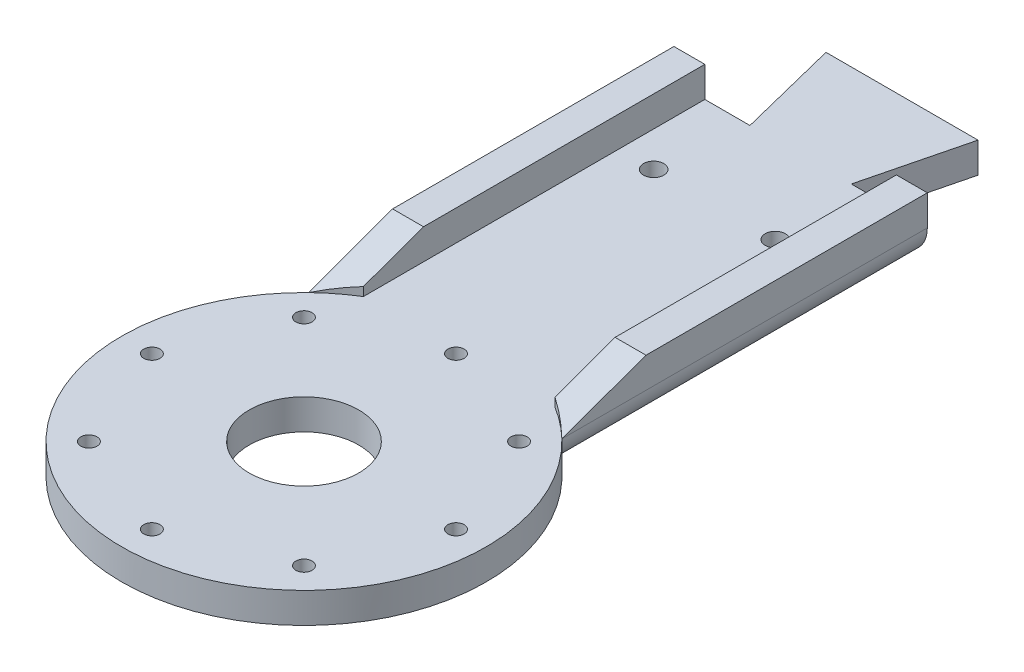
ISO-10303-21;
HEADER;
FILE_DESCRIPTION(('STEP AP214'),'2;1');
FILE_NAME('part.step','',(''),(''),'','','');
FILE_SCHEMA(('AUTOMOTIVE_DESIGN { 1 0 10303 214 1 1 1 1 }'));
ENDSEC;
DATA;
#1=APPLICATION_CONTEXT('core data for automotive mechanical design processes');
#2=APPLICATION_PROTOCOL_DEFINITION('international standard','automotive_design',2000,#1);
#3=PRODUCT_CONTEXT('',#1,'mechanical');
#4=PRODUCT('Part','Part','',(#3));
#5=PRODUCT_RELATED_PRODUCT_CATEGORY('part','',(#4));
#6=PRODUCT_DEFINITION_FORMATION('','',#4);
#7=PRODUCT_DEFINITION_CONTEXT('part definition',#1,'design');
#8=PRODUCT_DEFINITION('design','',#6,#7);
#9=PRODUCT_DEFINITION_SHAPE('','',#8);
#10=(LENGTH_UNIT() NAMED_UNIT(*) SI_UNIT(.MILLI.,.METRE.));
#11=(NAMED_UNIT(*) PLANE_ANGLE_UNIT() SI_UNIT($,.RADIAN.));
#12=(NAMED_UNIT(*) SI_UNIT($,.STERADIAN.) SOLID_ANGLE_UNIT());
#13=UNCERTAINTY_MEASURE_WITH_UNIT(LENGTH_MEASURE(1.E-05),#10,'distance_accuracy_value','');
#14=(GEOMETRIC_REPRESENTATION_CONTEXT(3) GLOBAL_UNCERTAINTY_ASSIGNED_CONTEXT((#13)) GLOBAL_UNIT_ASSIGNED_CONTEXT((#10,
#11,#12)) REPRESENTATION_CONTEXT('',''));
#15=CARTESIAN_POINT('',(0.,0.,0.));
#16=DIRECTION('',(0.,0.,1.));
#17=DIRECTION('',(1.,0.,0.));
#18=AXIS2_PLACEMENT_3D('',#15,#16,#17);
#19=CARTESIAN_POINT('',(0.226911438610488,3.,20.1632131954188));
#20=DIRECTION('',(0.,1.,0.));
#21=DIRECTION('',(0.,0.,1.));
#22=AXIS2_PLACEMENT_3D('',#19,#20,#21);
#23=PLANE('',#22);
#24=CARTESIAN_POINT('',(0.226911123610835,3.,20.1596174357801));
#25=DIRECTION('',(0.,-1.,0.));
#26=DIRECTION('',(0.,0.,1.));
#27=AXIS2_PLACEMENT_3D('',#24,#25,#26);
#28=CIRCLE('',#27,17.993847882213);
#29=CARTESIAN_POINT('',(-12.2730885613881,3.,7.21633464186544));
#30=VERTEX_POINT('',#29);
#31=CARTESIAN_POINT('',(-9.22308856138809,3.,4.84700604641411));
#32=VERTEX_POINT('',#31);
#33=EDGE_CURVE('E187',#30,#32,#28,.T.);
#34=ORIENTED_EDGE('',*,*,#33,.F.);
#35=CARTESIAN_POINT('',(0.226911438610488,3.,20.1632131954188));
#36=DIRECTION('',(0.,1.,0.));
#37=DIRECTION('',(0.,0.,1.));
#38=AXIS2_PLACEMENT_3D('',#35,#36,#37);
#39=CIRCLE('',#38,17.9964347658203);
#40=CARTESIAN_POINT('',(12.7269108086098,3.,7.21633464186544));
#41=VERTEX_POINT('',#40);
#42=EDGE_CURVE('E293',#30,#41,#39,.T.);
#43=ORIENTED_EDGE('',*,*,#42,.T.);
#44=CARTESIAN_POINT('',(0.226911123610835,3.,20.1596174357801));
#45=DIRECTION('',(0.,-1.,0.));
#46=DIRECTION('',(0.,0.,1.));
#47=AXIS2_PLACEMENT_3D('',#44,#45,#46);
#48=CIRCLE('',#47,17.993847882213);
#49=CARTESIAN_POINT('',(9.67691080860975,3.,4.8470060464141));
#50=VERTEX_POINT('',#49);
#51=EDGE_CURVE('E442',#50,#41,#48,.T.);
#52=ORIENTED_EDGE('',*,*,#51,.F.);
#53=DIRECTION('',(0.,0.,1.));
#54=VECTOR('',#53,1.);
#55=CARTESIAN_POINT('',(9.67691080860975,3.,-28.8400733137746));
#56=LINE('',#55,#54);
#57=CARTESIAN_POINT('',(9.67691080860975,3.,-28.8400733137746));
#58=VERTEX_POINT('',#57);
#59=EDGE_CURVE('E452',#58,#50,#56,.T.);
#60=ORIENTED_EDGE('',*,*,#59,.F.);
#61=DIRECTION('',(-1.,0.,0.));
#62=VECTOR('',#61,1.);
#63=CARTESIAN_POINT('',(5.22691143861272,3.,-28.8400733137746));
#64=LINE('',#63,#62);
#65=CARTESIAN_POINT('',(5.22691143861272,3.,-28.8400733137746));
#66=VERTEX_POINT('',#65);
#67=EDGE_CURVE('E297',#58,#66,#64,.T.);
#68=ORIENTED_EDGE('',*,*,#67,.T.);
#69=DIRECTION('',(0.242535625036222,0.,-0.97014250014536));
#70=VECTOR('',#69,1.);
#71=CARTESIAN_POINT('',(7.72691143861151,3.,-38.8400733137746));
#72=LINE('',#71,#70);
#73=CARTESIAN_POINT('',(7.72691143861151,3.,-38.8400733137746));
#74=VERTEX_POINT('',#73);
#75=EDGE_CURVE('E301',#66,#74,#72,.T.);
#76=ORIENTED_EDGE('',*,*,#75,.T.);
#77=DIRECTION('',(-1.,0.,0.));
#78=VECTOR('',#77,1.);
#79=CARTESIAN_POINT('',(-7.27308856138728,3.,-38.8400733137746));
#80=LINE('',#79,#78);
#81=CARTESIAN_POINT('',(-7.27308856138728,3.,-38.8400733137746));
#82=VERTEX_POINT('',#81);
#83=EDGE_CURVE('E304',#74,#82,#80,.T.);
#84=ORIENTED_EDGE('',*,*,#83,.T.);
#85=DIRECTION('',(0.242535625036222,0.,0.97014250014536));
#86=VECTOR('',#85,1.);
#87=CARTESIAN_POINT('',(-4.77308856138849,3.,-28.8400733137746));
#88=LINE('',#87,#86);
#89=CARTESIAN_POINT('',(-4.77308856138849,3.,-28.8400733137746));
#90=VERTEX_POINT('',#89);
#91=EDGE_CURVE('E307',#82,#90,#88,.T.);
#92=ORIENTED_EDGE('',*,*,#91,.T.);
#93=DIRECTION('',(-1.,0.,0.));
#94=VECTOR('',#93,1.);
#95=CARTESIAN_POINT('',(-12.2730885613881,3.,-28.8400733137746));
#96=LINE('',#95,#94);
#97=CARTESIAN_POINT('',(-9.22308856138809,3.,-28.8400733137746));
#98=VERTEX_POINT('',#97);
#99=EDGE_CURVE('E310',#90,#98,#96,.T.);
#100=ORIENTED_EDGE('',*,*,#99,.T.);
#101=DIRECTION('',(0.,0.,-1.));
#102=VECTOR('',#101,1.);
#103=CARTESIAN_POINT('',(-9.22308856138809,3.,-28.8400733137746));
#104=LINE('',#103,#102);
#105=EDGE_CURVE('E181',#32,#98,#104,.T.);
#106=ORIENTED_EDGE('',*,*,#105,.F.);
#107=EDGE_LOOP('',(#34,#43,#52,#60,#68,#76,#84,#92,#100,#106));
#108=FACE_BOUND('',#107,.T.);
#109=CARTESIAN_POINT('',(-5.77308837033677,3.,-20.3403823597509));
#110=DIRECTION('',(0.,1.,0.));
#111=DIRECTION('',(0.,0.,1.));
#112=AXIS2_PLACEMENT_3D('',#109,#110,#111);
#113=CIRCLE('',#112,1.00000002430657);
#114=CARTESIAN_POINT('',(-5.77308837033677,3.,-19.3403823354443));
#115=VERTEX_POINT('',#114);
#116=EDGE_CURVE('E270',#115,#115,#113,.T.);
#117=ORIENTED_EDGE('',*,*,#116,.F.);
#118=EDGE_LOOP('',(#117));
#119=FACE_BOUND('',#118,.T.);
#120=CARTESIAN_POINT('',(6.2269114386117,3.,-20.3403822770759));
#121=DIRECTION('',(0.,1.,0.));
#122=DIRECTION('',(0.,0.,1.));
#123=AXIS2_PLACEMENT_3D('',#120,#121,#122);
#124=CIRCLE('',#123,0.999999877106538);
#125=CARTESIAN_POINT('',(6.2269114386117,3.,-19.3403823999694));
#126=VERTEX_POINT('',#125);
#127=EDGE_CURVE('E278',#126,#126,#124,.T.);
#128=ORIENTED_EDGE('',*,*,#127,.F.);
#129=EDGE_LOOP('',(#128));
#130=FACE_BOUND('',#129,.T.);
#131=CARTESIAN_POINT('',(0.226911438611895,3.,5.15961765623719));
#132=DIRECTION('',(0.,1.,0.));
#133=DIRECTION('',(0.,0.,1.));
#134=AXIS2_PLACEMENT_3D('',#131,#132,#133);
#135=CIRCLE('',#134,0.800000202769333);
#136=CARTESIAN_POINT('',(0.226911438611895,3.,5.95961785900653));
#137=VERTEX_POINT('',#136);
#138=EDGE_CURVE('E262',#137,#137,#135,.T.);
#139=ORIENTED_EDGE('',*,*,#138,.F.);
#140=EDGE_LOOP('',(#139));
#141=FACE_BOUND('',#140,.T.);
#142=CARTESIAN_POINT('',(-14.7766841005684,3.,20.1632131954201));
#143=DIRECTION('',(0.,1.,0.));
#144=DIRECTION('',(0.,0.,1.));
#145=AXIS2_PLACEMENT_3D('',#142,#143,#144);
#146=CIRCLE('',#145,0.800000202769333);
#147=CARTESIAN_POINT('',(-14.7766841005684,3.,20.9632133981894));
#148=VERTEX_POINT('',#147);
#149=EDGE_CURVE('E214',#148,#148,#146,.T.);
#150=ORIENTED_EDGE('',*,*,#149,.F.);
#151=EDGE_LOOP('',(#150));
#152=FACE_BOUND('',#151,.T.);
#153=CARTESIAN_POINT('',(0.226911438614583,3.,35.1668087346005));
#154=DIRECTION('',(0.,1.,0.));
#155=DIRECTION('',(0.,0.,1.));
#156=AXIS2_PLACEMENT_3D('',#153,#154,#155);
#157=CIRCLE('',#156,0.800000202769338);
#158=CARTESIAN_POINT('',(0.226911438614583,3.,35.9668089373698));
#159=VERTEX_POINT('',#158);
#160=EDGE_CURVE('E230',#159,#159,#157,.T.);
#161=ORIENTED_EDGE('',*,*,#160,.F.);
#162=EDGE_LOOP('',(#161));
#163=FACE_BOUND('',#162,.T.);
#164=CARTESIAN_POINT('',(15.2305069777949,3.,20.1632131954175));
#165=DIRECTION('',(0.,1.,0.));
#166=DIRECTION('',(0.,0.,1.));
#167=AXIS2_PLACEMENT_3D('',#164,#165,#166);
#168=CIRCLE('',#167,0.800000202769333);
#169=CARTESIAN_POINT('',(15.2305069777949,3.,20.9632133981868));
#170=VERTEX_POINT('',#169);
#171=EDGE_CURVE('E246',#170,#170,#168,.T.);
#172=ORIENTED_EDGE('',*,*,#171,.F.);
#173=EDGE_LOOP('',(#172));
#174=FACE_BOUND('',#173,.T.);
#175=CARTESIAN_POINT('',(0.226911123610835,3.,20.1596174357801));
#176=DIRECTION('',(0.,1.,0.));
#177=DIRECTION('',(0.,0.,1.));
#178=AXIS2_PLACEMENT_3D('',#175,#176,#177);
#179=CIRCLE('',#178,5.40000008825084);
#180=CARTESIAN_POINT('',(0.226911123610835,3.,25.5596175240309));
#181=VERTEX_POINT('',#180);
#182=EDGE_CURVE('E286',#181,#181,#179,.T.);
#183=ORIENTED_EDGE('',*,*,#182,.F.);
#184=EDGE_LOOP('',(#183));
#185=FACE_BOUND('',#184,.T.);
#186=CARTESIAN_POINT('',(10.8360555865479,3.,9.55406904748229));
#187=DIRECTION('',(0.,1.,0.));
#188=DIRECTION('',(0.,0.,1.));
#189=AXIS2_PLACEMENT_3D('',#186,#187,#188);
#190=CIRCLE('',#189,0.80000020276933);
#191=CARTESIAN_POINT('',(10.8360555865479,3.,10.3540692502516));
#192=VERTEX_POINT('',#191);
#193=EDGE_CURVE('E254',#192,#192,#190,.T.);
#194=ORIENTED_EDGE('',*,*,#193,.F.);
#195=EDGE_LOOP('',(#194));
#196=FACE_BOUND('',#195,.T.);
#197=CARTESIAN_POINT('',(10.8360555865498,3.,30.7723573433535));
#198=DIRECTION('',(0.,1.,0.));
#199=DIRECTION('',(0.,0.,1.));
#200=AXIS2_PLACEMENT_3D('',#197,#198,#199);
#201=CIRCLE('',#200,0.800000202769333);
#202=CARTESIAN_POINT('',(10.8360555865498,3.,31.5723575461228));
#203=VERTEX_POINT('',#202);
#204=EDGE_CURVE('E238',#203,#203,#201,.T.);
#205=ORIENTED_EDGE('',*,*,#204,.F.);
#206=EDGE_LOOP('',(#205));
#207=FACE_BOUND('',#206,.T.);
#208=CARTESIAN_POINT('',(-10.3822327093214,3.,30.7723573433553));
#209=DIRECTION('',(0.,1.,0.));
#210=DIRECTION('',(0.,0.,1.));
#211=AXIS2_PLACEMENT_3D('',#208,#209,#210);
#212=CIRCLE('',#211,0.800000202769334);
#213=CARTESIAN_POINT('',(-10.3822327093214,3.,31.5723575461246));
#214=VERTEX_POINT('',#213);
#215=EDGE_CURVE('E222',#214,#214,#212,.T.);
#216=ORIENTED_EDGE('',*,*,#215,.F.);
#217=EDGE_LOOP('',(#216));
#218=FACE_BOUND('',#217,.T.);
#219=CARTESIAN_POINT('',(-10.3822327093231,3.,9.55406904748412));
#220=DIRECTION('',(0.,1.,0.));
#221=DIRECTION('',(0.,0.,1.));
#222=AXIS2_PLACEMENT_3D('',#219,#220,#221);
#223=CIRCLE('',#222,0.800000202769332);
#224=CARTESIAN_POINT('',(-10.3822327093231,3.,10.3540692502534));
#225=VERTEX_POINT('',#224);
#226=EDGE_CURVE('E206',#225,#225,#223,.T.);
#227=ORIENTED_EDGE('',*,*,#226,.F.);
#228=EDGE_LOOP('',(#227));
#229=FACE_BOUND('',#228,.T.);
#230=ADVANCED_FACE('F39',(#108,#119,#130,#141,#152,#163,#174,#185,#196,#207,#218,#229),#23,.T.);
#231=CARTESIAN_POINT('',(0.226911438610488,0.,20.1632131954188));
#232=DIRECTION('',(0.,1.,0.));
#233=DIRECTION('',(0.,0.,1.));
#234=AXIS2_PLACEMENT_3D('',#231,#232,#233);
#235=PLANE('',#234);
#236=DIRECTION('',(-1.,0.,0.));
#237=VECTOR('',#236,1.);
#238=CARTESIAN_POINT('',(5.22691143861272,0.,-28.8400733137746));
#239=LINE('',#238,#237);
#240=CARTESIAN_POINT('',(9.72691143860919,0.,-28.8400733137746));
#241=VERTEX_POINT('',#240);
#242=CARTESIAN_POINT('',(5.22691143861272,0.,-28.8400733137746));
#243=VERTEX_POINT('',#242);
#244=EDGE_CURVE('E316',#241,#243,#239,.T.);
#245=ORIENTED_EDGE('',*,*,#244,.F.);
#246=DIRECTION('',(0.,0.,-1.));
#247=VECTOR('',#246,1.);
#248=CARTESIAN_POINT('',(9.72691143860919,0.,20.1632131954188));
#249=LINE('',#248,#247);
#250=CARTESIAN_POINT('',(9.72691143860919,0.,4.87852594704997));
#251=VERTEX_POINT('',#250);
#252=EDGE_CURVE('E365',#241,#251,#249,.F.);
#253=ORIENTED_EDGE('',*,*,#252,.T.);
#254=CARTESIAN_POINT('',(0.226911438610488,0.,20.1632131954188));
#255=DIRECTION('',(0.,1.,0.));
#256=DIRECTION('',(0.,0.,1.));
#257=AXIS2_PLACEMENT_3D('',#254,#255,#256);
#258=CIRCLE('',#257,17.9964347658203);
#259=CARTESIAN_POINT('',(-9.27308856138809,0.,4.87852594704989));
#260=VERTEX_POINT('',#259);
#261=EDGE_CURVE('E68',#260,#251,#258,.T.);
#262=ORIENTED_EDGE('',*,*,#261,.F.);
#263=DIRECTION('',(0.,0.,1.));
#264=VECTOR('',#263,1.);
#265=CARTESIAN_POINT('',(-9.27308856138809,0.,20.1632131954188));
#266=LINE('',#265,#264);
#267=CARTESIAN_POINT('',(-9.27308856138809,0.,-28.8400733137746));
#268=VERTEX_POINT('',#267);
#269=EDGE_CURVE('E362',#260,#268,#266,.F.);
#270=ORIENTED_EDGE('',*,*,#269,.T.);
#271=DIRECTION('',(-1.,0.,0.));
#272=VECTOR('',#271,1.);
#273=CARTESIAN_POINT('',(-12.2730885613881,0.,-28.8400733137746));
#274=LINE('',#273,#272);
#275=CARTESIAN_POINT('',(-4.77308856138849,0.,-28.8400733137746));
#276=VERTEX_POINT('',#275);
#277=EDGE_CURVE('E298',#276,#268,#274,.T.);
#278=ORIENTED_EDGE('',*,*,#277,.F.);
#279=DIRECTION('',(0.242535625036222,0.,0.97014250014536));
#280=VECTOR('',#279,1.);
#281=CARTESIAN_POINT('',(-4.77308856138849,0.,-28.8400733137746));
#282=LINE('',#281,#280);
#283=CARTESIAN_POINT('',(-7.27308856138728,0.,-38.8400733137746));
#284=VERTEX_POINT('',#283);
#285=EDGE_CURVE('E325',#284,#276,#282,.T.);
#286=ORIENTED_EDGE('',*,*,#285,.F.);
#287=DIRECTION('',(-1.,0.,0.));
#288=VECTOR('',#287,1.);
#289=CARTESIAN_POINT('',(-7.27308856138728,0.,-38.8400733137746));
#290=LINE('',#289,#288);
#291=CARTESIAN_POINT('',(7.72691143861151,0.,-38.8400733137746));
#292=VERTEX_POINT('',#291);
#293=EDGE_CURVE('E322',#292,#284,#290,.T.);
#294=ORIENTED_EDGE('',*,*,#293,.F.);
#295=DIRECTION('',(0.242535625036222,0.,-0.97014250014536));
#296=VECTOR('',#295,1.);
#297=CARTESIAN_POINT('',(7.72691143861151,0.,-38.8400733137746));
#298=LINE('',#297,#296);
#299=EDGE_CURVE('E319',#243,#292,#298,.T.);
#300=ORIENTED_EDGE('',*,*,#299,.F.);
#301=EDGE_LOOP('',(#245,#253,#262,#270,#278,#286,#294,#300));
#302=FACE_BOUND('',#301,.T.);
#303=CARTESIAN_POINT('',(0.226911123610835,0.,20.1596174357801));
#304=DIRECTION('',(0.,1.,0.));
#305=DIRECTION('',(0.,0.,1.));
#306=AXIS2_PLACEMENT_3D('',#303,#304,#305);
#307=CIRCLE('',#306,5.40000008825084);
#308=CARTESIAN_POINT('',(0.226911123610835,0.,25.5596175240309));
#309=VERTEX_POINT('',#308);
#310=EDGE_CURVE('E282',#309,#309,#307,.T.);
#311=ORIENTED_EDGE('',*,*,#310,.T.);
#312=EDGE_LOOP('',(#311));
#313=FACE_BOUND('',#312,.T.);
#314=CARTESIAN_POINT('',(6.2269114386117,0.,-20.3403822770759));
#315=DIRECTION('',(0.,1.,0.));
#316=DIRECTION('',(0.,0.,1.));
#317=AXIS2_PLACEMENT_3D('',#314,#315,#316);
#318=CIRCLE('',#317,0.999999877106538);
#319=CARTESIAN_POINT('',(6.2269114386117,0.,-19.3403823999694));
#320=VERTEX_POINT('',#319);
#321=EDGE_CURVE('E274',#320,#320,#318,.T.);
#322=ORIENTED_EDGE('',*,*,#321,.T.);
#323=EDGE_LOOP('',(#322));
#324=FACE_BOUND('',#323,.T.);
#325=CARTESIAN_POINT('',(-5.77308837033677,0.,-20.3403823597509));
#326=DIRECTION('',(0.,1.,0.));
#327=DIRECTION('',(0.,0.,1.));
#328=AXIS2_PLACEMENT_3D('',#325,#326,#327);
#329=CIRCLE('',#328,1.00000002430657);
#330=CARTESIAN_POINT('',(-5.77308837033677,0.,-19.3403823354443));
#331=VERTEX_POINT('',#330);
#332=EDGE_CURVE('E266',#331,#331,#329,.T.);
#333=ORIENTED_EDGE('',*,*,#332,.T.);
#334=EDGE_LOOP('',(#333));
#335=FACE_BOUND('',#334,.T.);
#336=CARTESIAN_POINT('',(0.226911438611895,0.,5.15961765623719));
#337=DIRECTION('',(0.,1.,0.));
#338=DIRECTION('',(0.,0.,1.));
#339=AXIS2_PLACEMENT_3D('',#336,#337,#338);
#340=CIRCLE('',#339,0.800000202769333);
#341=CARTESIAN_POINT('',(0.226911438611895,0.,5.95961785900653));
#342=VERTEX_POINT('',#341);
#343=EDGE_CURVE('E258',#342,#342,#340,.T.);
#344=ORIENTED_EDGE('',*,*,#343,.T.);
#345=EDGE_LOOP('',(#344));
#346=FACE_BOUND('',#345,.T.);
#347=CARTESIAN_POINT('',(10.8360555865479,0.,9.55406904748229));
#348=DIRECTION('',(0.,1.,0.));
#349=DIRECTION('',(0.,0.,1.));
#350=AXIS2_PLACEMENT_3D('',#347,#348,#349);
#351=CIRCLE('',#350,0.80000020276933);
#352=CARTESIAN_POINT('',(10.8360555865479,0.,10.3540692502516));
#353=VERTEX_POINT('',#352);
#354=EDGE_CURVE('E250',#353,#353,#351,.T.);
#355=ORIENTED_EDGE('',*,*,#354,.T.);
#356=EDGE_LOOP('',(#355));
#357=FACE_BOUND('',#356,.T.);
#358=CARTESIAN_POINT('',(15.2305069777949,0.,20.1632131954175));
#359=DIRECTION('',(0.,1.,0.));
#360=DIRECTION('',(0.,0.,1.));
#361=AXIS2_PLACEMENT_3D('',#358,#359,#360);
#362=CIRCLE('',#361,0.800000202769333);
#363=CARTESIAN_POINT('',(15.2305069777949,0.,20.9632133981868));
#364=VERTEX_POINT('',#363);
#365=EDGE_CURVE('E242',#364,#364,#362,.T.);
#366=ORIENTED_EDGE('',*,*,#365,.T.);
#367=EDGE_LOOP('',(#366));
#368=FACE_BOUND('',#367,.T.);
#369=CARTESIAN_POINT('',(10.8360555865498,0.,30.7723573433535));
#370=DIRECTION('',(0.,1.,0.));
#371=DIRECTION('',(0.,0.,1.));
#372=AXIS2_PLACEMENT_3D('',#369,#370,#371);
#373=CIRCLE('',#372,0.800000202769333);
#374=CARTESIAN_POINT('',(10.8360555865498,0.,31.5723575461228));
#375=VERTEX_POINT('',#374);
#376=EDGE_CURVE('E234',#375,#375,#373,.T.);
#377=ORIENTED_EDGE('',*,*,#376,.T.);
#378=EDGE_LOOP('',(#377));
#379=FACE_BOUND('',#378,.T.);
#380=CARTESIAN_POINT('',(0.226911438614583,0.,35.1668087346005));
#381=DIRECTION('',(0.,1.,0.));
#382=DIRECTION('',(0.,0.,1.));
#383=AXIS2_PLACEMENT_3D('',#380,#381,#382);
#384=CIRCLE('',#383,0.800000202769338);
#385=CARTESIAN_POINT('',(0.226911438614583,0.,35.9668089373698));
#386=VERTEX_POINT('',#385);
#387=EDGE_CURVE('E226',#386,#386,#384,.T.);
#388=ORIENTED_EDGE('',*,*,#387,.T.);
#389=EDGE_LOOP('',(#388));
#390=FACE_BOUND('',#389,.T.);
#391=CARTESIAN_POINT('',(-10.3822327093214,0.,30.7723573433553));
#392=DIRECTION('',(0.,1.,0.));
#393=DIRECTION('',(0.,0.,1.));
#394=AXIS2_PLACEMENT_3D('',#391,#392,#393);
#395=CIRCLE('',#394,0.800000202769334);
#396=CARTESIAN_POINT('',(-10.3822327093214,0.,31.5723575461246));
#397=VERTEX_POINT('',#396);
#398=EDGE_CURVE('E218',#397,#397,#395,.T.);
#399=ORIENTED_EDGE('',*,*,#398,.T.);
#400=EDGE_LOOP('',(#399));
#401=FACE_BOUND('',#400,.T.);
#402=CARTESIAN_POINT('',(-14.7766841005684,0.,20.1632131954201));
#403=DIRECTION('',(0.,1.,0.));
#404=DIRECTION('',(0.,0.,1.));
#405=AXIS2_PLACEMENT_3D('',#402,#403,#404);
#406=CIRCLE('',#405,0.800000202769333);
#407=CARTESIAN_POINT('',(-14.7766841005684,0.,20.9632133981894));
#408=VERTEX_POINT('',#407);
#409=EDGE_CURVE('E210',#408,#408,#406,.T.);
#410=ORIENTED_EDGE('',*,*,#409,.T.);
#411=EDGE_LOOP('',(#410));
#412=FACE_BOUND('',#411,.T.);
#413=CARTESIAN_POINT('',(-10.3822327093231,0.,9.55406904748412));
#414=DIRECTION('',(0.,1.,0.));
#415=DIRECTION('',(0.,0.,1.));
#416=AXIS2_PLACEMENT_3D('',#413,#414,#415);
#417=CIRCLE('',#416,0.800000202769332);
#418=CARTESIAN_POINT('',(-10.3822327093231,0.,10.3540692502534));
#419=VERTEX_POINT('',#418);
#420=EDGE_CURVE('E205',#419,#419,#417,.T.);
#421=ORIENTED_EDGE('',*,*,#420,.T.);
#422=EDGE_LOOP('',(#421));
#423=FACE_BOUND('',#422,.T.);
#424=ADVANCED_FACE('F385',(#302,#313,#324,#335,#346,#357,#368,#379,#390,#401,#412,#423),#235,.F.);
#425=CARTESIAN_POINT('',(-12.2730885613881,3.,-28.8400733137746));
#426=DIRECTION('',(1.,0.,0.));
#427=DIRECTION('',(0.,0.,-1.));
#428=AXIS2_PLACEMENT_3D('',#425,#426,#427);
#429=PLANE('',#428);
#430=DIRECTION('',(0.,-1.,0.));
#431=VECTOR('',#430,1.);
#432=CARTESIAN_POINT('',(-12.2730885613881,3.,-28.8400733137746));
#433=LINE('',#432,#431);
#434=CARTESIAN_POINT('',(-12.2730885613881,6.,-28.8400733137746));
#435=VERTEX_POINT('',#434);
#436=CARTESIAN_POINT('',(-12.2730885613881,3.,-28.8400733137746));
#437=VERTEX_POINT('',#436);
#438=EDGE_CURVE('E313',#435,#437,#433,.T.);
#439=ORIENTED_EDGE('',*,*,#438,.T.);
#440=DIRECTION('',(0.,0.,1.));
#441=VECTOR('',#440,1.);
#442=CARTESIAN_POINT('',(-12.2730885613881,3.,-28.8400733137746));
#443=LINE('',#442,#441);
#444=EDGE_CURVE('E172',#437,#30,#443,.T.);
#445=ORIENTED_EDGE('',*,*,#444,.T.);
#446=DIRECTION('',(0.,-0.339922884021923,0.940453312460655));
#447=VECTOR('',#446,1.);
#448=CARTESIAN_POINT('',(-12.2730885613881,6.,-1.08366535813456));
#449=LINE('',#448,#447);
#450=CARTESIAN_POINT('',(-12.2730885613881,6.,-1.08366535813456));
#451=VERTEX_POINT('',#450);
#452=EDGE_CURVE('E156',#451,#30,#449,.T.);
#453=ORIENTED_EDGE('',*,*,#452,.F.);
#454=DIRECTION('',(0.,0.,1.));
#455=VECTOR('',#454,1.);
#456=CARTESIAN_POINT('',(-12.2730885613881,6.,-28.8400733137746));
#457=LINE('',#456,#455);
#458=EDGE_CURVE('E170',#435,#451,#457,.T.);
#459=ORIENTED_EDGE('',*,*,#458,.F.);
#460=EDGE_LOOP('',(#439,#445,#453,#459));
#461=FACE_BOUND('',#460,.T.);
#462=ADVANCED_FACE('F169',(#461),#429,.F.);
#463=CARTESIAN_POINT('',(0.226911438610488,3.,20.1632131954188));
#464=DIRECTION('',(0.,-1.,0.));
#465=DIRECTION('',(0.,0.,-1.));
#466=AXIS2_PLACEMENT_3D('',#463,#464,#465);
#467=CYLINDRICAL_SURFACE('',#466,17.9964347658203);
#468=ORIENTED_EDGE('',*,*,#261,.T.);
#469=CARTESIAN_POINT('',(9.72691143860919,0.,4.87852594704997));
#470=CARTESIAN_POINT('',(9.83532383917242,7.70221850014328E-06,4.94589163160942));
#471=CARTESIAN_POINT('',(9.94296979444799,0.0058756981207801,5.01441259473733));
#472=CARTESIAN_POINT('',(10.1559088019641,0.0288998195278392,5.15312716215045));
#473=CARTESIAN_POINT('',(10.2612025984383,0.0460523207221585,5.22332022242453));
#474=CARTESIAN_POINT('',(10.4690035908862,0.0912822670487372,5.36500035745983));
#475=CARTESIAN_POINT('',(10.5715013318127,0.119392799273115,5.43649072003552));
#476=CARTESIAN_POINT('',(10.7726707022109,0.186173070125989,5.57986966557676));
#477=CARTESIAN_POINT('',(10.8713421917868,0.224843194420327,5.65175826299298));
#478=CARTESIAN_POINT('',(11.1489038050057,0.350939908094248,5.85823215865373));
#479=CARTESIAN_POINT('',(11.3222899006691,0.451390858007223,5.99253498282381));
#480=CARTESIAN_POINT('',(11.6487245662191,0.687604782369549,6.25431270271033));
#481=CARTESIAN_POINT('',(11.8018045901168,0.823312156681161,6.38179797152536));
#482=CARTESIAN_POINT('',(12.0424943486716,1.08680372448396,6.58818674170604));
#483=CARTESIAN_POINT('',(12.1363991324814,1.20604990116792,6.67065883100823));
#484=CARTESIAN_POINT('',(12.3076769697389,1.46267812241918,6.82380140761));
#485=CARTESIAN_POINT('',(12.3850748465863,1.60003242500841,6.89448958032417));
#486=CARTESIAN_POINT('',(12.5054923182628,1.86168251178784,7.00595502091786));
#487=CARTESIAN_POINT('',(12.552307351527,1.98287414749725,7.04989354035619));
#488=CARTESIAN_POINT('',(12.6304560039853,2.23408311900182,7.12378615275434));
#489=CARTESIAN_POINT('',(12.6618258979325,2.36407895155186,7.15377300366013));
#490=CARTESIAN_POINT('',(12.6984203475744,2.5791481220453,7.18887259491785));
#491=CARTESIAN_POINT('',(12.7090507518218,2.66251046220366,7.19910778732025));
#492=CARTESIAN_POINT('',(12.7233186764939,2.83055626028297,7.21286570516418));
#493=CARTESIAN_POINT('',(12.7269410582999,2.91524218075166,7.21637389890576));
#494=CARTESIAN_POINT('',(12.7269114386092,3.,7.21633464186556));
#495=B_SPLINE_CURVE_WITH_KNOTS('',3,(#469,#470,#471,#472,#473,#474,#475,#476,#477,#478,#479,
#480,#481,#482,#483,#484,#485,#486,#487,#488,#489,#490,#491,#492,#493,#494),.UNSPECIFIED.,.F.,
.F.,(4,2,2,2,2,2,2,2,2,2,2,2,4),(0.,0.382710447070088,0.765298036758656,1.14904988705858,
1.53281575492461,2.25299818959785,2.97205170342164,3.48853805287306,4.00424213655958,
4.41412167833777,4.82303392166929,5.07648252673355,5.33047801879585),.UNSPECIFIED.);
#496=EDGE_CURVE('E54',#251,#41,#495,.T.);
#497=ORIENTED_EDGE('',*,*,#496,.T.);
#498=ORIENTED_EDGE('',*,*,#42,.F.);
#499=CARTESIAN_POINT('',(-12.2730885613881,3.,7.21633464186544));
#500=CARTESIAN_POINT('',(-12.2731061602408,2.93075540376491,7.21635682136357));
#501=CARTESIAN_POINT('',(-12.2706918095605,2.86152658959577,7.21402071427191));
#502=CARTESIAN_POINT('',(-12.2611361226338,2.72376333756891,7.20480233731879));
#503=CARTESIAN_POINT('',(-12.2539991840498,2.65522831387969,7.19792429690678));
#504=CARTESIAN_POINT('',(-12.235222854675,2.52001874615603,7.17987654924136));
#505=CARTESIAN_POINT('',(-12.2236261328917,2.45333280474815,7.16874751997701));
#506=CARTESIAN_POINT('',(-12.1961658454706,2.32165759093721,7.14249213015941));
#507=CARTESIAN_POINT('',(-12.1803015089267,2.25666862740713,7.12736504740247));
#508=CARTESIAN_POINT('',(-12.1268356573208,2.06534537248049,7.07661669107271));
#509=CARTESIAN_POINT('',(-12.0832738324657,1.94205042340578,7.03554283925489));
#510=CARTESIAN_POINT('',(-11.9825735570699,1.70566545159301,6.94183371824722));
#511=CARTESIAN_POINT('',(-11.9253981080556,1.59260441844688,6.8891669724192));
#512=CARTESIAN_POINT('',(-11.7728052566779,1.33177407948292,6.75079195706028));
#513=CARTESIAN_POINT('',(-11.6714890760277,1.18983242702024,6.66058416065979));
#514=CARTESIAN_POINT('',(-11.4507320557653,0.929468995030985,6.46920997197785));
#515=CARTESIAN_POINT('',(-11.331265244609,0.811081488654337,6.3680279371035));
#516=CARTESIAN_POINT('',(-11.0750612542071,0.595525590415507,6.15731501434884));
#517=CARTESIAN_POINT('',(-10.9380107281868,0.498862206286857,6.04765230438127));
#518=CARTESIAN_POINT('',(-10.6515505033855,0.33027585366215,5.8257272511155));
#519=CARTESIAN_POINT('',(-10.5021495412495,0.258335578817802,5.71346678525915));
#520=CARTESIAN_POINT('',(-10.263166776421,0.166632410398366,5.53991205848754));
#521=CARTESIAN_POINT('',(-10.1769992112709,0.13797098375913,5.47846886516619));
#522=CARTESIAN_POINT('',(-10.0020682963556,0.0884972555407832,5.35608590840701));
#523=CARTESIAN_POINT('',(-9.91330500313464,0.0676847831203462,5.29514613403995));
#524=CARTESIAN_POINT('',(-9.73355315456303,0.0341374245599102,5.17413238507985));
#525=CARTESIAN_POINT('',(-9.64256248563684,0.021410545975147,5.11405932618281));
#526=CARTESIAN_POINT('',(-9.45893029421167,0.00434267955020678,4.99521487070898));
#527=CARTESIAN_POINT('',(-9.36628836629768,3.78055438146159E-06,4.9364438019657));
#528=CARTESIAN_POINT('',(-9.27308856138809,0.,4.87852594704989));
#529=B_SPLINE_CURVE_WITH_KNOTS('',3,(#499,#500,#501,#502,#503,#504,#505,#506,#507,#508,#509,
#510,#511,#512,#513,#514,#515,#516,#517,#518,#519,#520,#521,#522,#523,#524,#525,#526,#527,#528),
.UNSPECIFIED.,.F.,.F.,(4,2,2,2,2,2,2,2,2,2,2,2,2,2,4),(0.,0.207626746449687,0.41506042294929,
0.620556959365418,0.826090641835499,1.2353329879079,1.64570051076167,2.23151888836623,
2.81818354232827,3.4173291707116,4.01605453459768,4.34471982322983,4.673377957679,
5.00236107289589,5.33142610367274),.UNSPECIFIED.);
#530=EDGE_CURVE('E11',#30,#260,#529,.T.);
#531=ORIENTED_EDGE('',*,*,#530,.T.);
#532=EDGE_LOOP('',(#468,#497,#498,#531));
#533=FACE_BOUND('',#532,.T.);
#534=ADVANCED_FACE('F376',(#533),#467,.T.);
#535=CARTESIAN_POINT('',(12.7269114386092,3.,-28.8400733137746));
#536=DIRECTION('',(-1.,0.,0.));
#537=DIRECTION('',(0.,0.,1.));
#538=AXIS2_PLACEMENT_3D('',#535,#536,#537);
#539=PLANE('',#538);
#540=DIRECTION('',(0.,-0.339922884021923,0.940453312460655));
#541=VECTOR('',#540,1.);
#542=CARTESIAN_POINT('',(12.7269114386092,14.5265702669847,-24.6738430967922));
#543=LINE('',#542,#541);
#544=CARTESIAN_POINT('',(12.7269108086098,6.,-1.08366535813456));
#545=VERTEX_POINT('',#544);
#546=EDGE_CURVE('E428',#545,#41,#543,.T.);
#547=ORIENTED_EDGE('',*,*,#546,.T.);
#548=DIRECTION('',(0.,0.,-1.));
#549=VECTOR('',#548,1.);
#550=CARTESIAN_POINT('',(12.7269114386092,3.,-28.8400733137746));
#551=LINE('',#550,#549);
#552=CARTESIAN_POINT('',(12.7269114386092,3.,-28.8400733137746));
#553=VERTEX_POINT('',#552);
#554=EDGE_CURVE('E355',#41,#553,#551,.T.);
#555=ORIENTED_EDGE('',*,*,#554,.T.);
#556=DIRECTION('',(0.,-1.,0.));
#557=VECTOR('',#556,1.);
#558=CARTESIAN_POINT('',(12.7269114386092,3.,-28.8400733137746));
#559=LINE('',#558,#557);
#560=CARTESIAN_POINT('',(12.7269108086097,6.,-28.8400733137746));
#561=VERTEX_POINT('',#560);
#562=EDGE_CURVE('E348',#561,#553,#559,.T.);
#563=ORIENTED_EDGE('',*,*,#562,.F.);
#564=DIRECTION('',(0.,0.,-1.));
#565=VECTOR('',#564,1.);
#566=CARTESIAN_POINT('',(12.7269108086097,6.,-28.8400733137746));
#567=LINE('',#566,#565);
#568=EDGE_CURVE('E431',#545,#561,#567,.T.);
#569=ORIENTED_EDGE('',*,*,#568,.F.);
#570=EDGE_LOOP('',(#547,#555,#563,#569));
#571=FACE_BOUND('',#570,.T.);
#572=ADVANCED_FACE('F390',(#571),#539,.F.);
#573=CARTESIAN_POINT('',(5.22691143861272,3.,-28.8400733137746));
#574=DIRECTION('',(0.,0.,1.));
#575=DIRECTION('',(1.,0.,0.));
#576=AXIS2_PLACEMENT_3D('',#573,#574,#575);
#577=PLANE('',#576);
#578=ORIENTED_EDGE('',*,*,#562,.T.);
#579=CARTESIAN_POINT('',(9.72691143860919,3.,-28.8400733137746));
#580=DIRECTION('',(0.,0.,1.));
#581=DIRECTION('',(1.,0.,0.));
#582=AXIS2_PLACEMENT_3D('',#579,#580,#581);
#583=CIRCLE('',#582,3.);
#584=EDGE_CURVE('E359',#553,#241,#583,.F.);
#585=ORIENTED_EDGE('',*,*,#584,.T.);
#586=ORIENTED_EDGE('',*,*,#244,.T.);
#587=DIRECTION('',(0.,-1.,0.));
#588=VECTOR('',#587,1.);
#589=CARTESIAN_POINT('',(5.22691143861272,3.,-28.8400733137746));
#590=LINE('',#589,#588);
#591=EDGE_CURVE('E344',#66,#243,#590,.T.);
#592=ORIENTED_EDGE('',*,*,#591,.F.);
#593=ORIENTED_EDGE('',*,*,#67,.F.);
#594=DIRECTION('',(0.,-1.,0.));
#595=VECTOR('',#594,1.);
#596=CARTESIAN_POINT('',(9.67691080860975,6.,-28.8400733137746));
#597=LINE('',#596,#595);
#598=CARTESIAN_POINT('',(9.67691080860975,6.,-28.8400733137746));
#599=VERTEX_POINT('',#598);
#600=EDGE_CURVE('E190',#599,#58,#597,.T.);
#601=ORIENTED_EDGE('',*,*,#600,.F.);
#602=DIRECTION('',(-1.,0.,0.));
#603=VECTOR('',#602,1.);
#604=CARTESIAN_POINT('',(12.7269108086097,6.,-28.8400733137746));
#605=LINE('',#604,#603);
#606=EDGE_CURVE('E451',#561,#599,#605,.T.);
#607=ORIENTED_EDGE('',*,*,#606,.F.);
#608=EDGE_LOOP('',(#578,#585,#586,#592,#593,#601,#607));
#609=FACE_BOUND('',#608,.T.);
#610=ADVANCED_FACE('F418',(#609),#577,.F.);
#611=CARTESIAN_POINT('',(7.72691143861151,3.,-38.8400733137746));
#612=DIRECTION('',(-0.970142500145359,0.,-0.242535625036222));
#613=DIRECTION('',(-0.242535625036222,0.,0.97014250014536));
#614=AXIS2_PLACEMENT_3D('',#611,#612,#613);
#615=PLANE('',#614);
#616=ORIENTED_EDGE('',*,*,#299,.T.);
#617=DIRECTION('',(0.,-1.,0.));
#618=VECTOR('',#617,1.);
#619=CARTESIAN_POINT('',(7.72691143861151,3.,-38.8400733137746));
#620=LINE('',#619,#618);
#621=EDGE_CURVE('E340',#74,#292,#620,.T.);
#622=ORIENTED_EDGE('',*,*,#621,.F.);
#623=ORIENTED_EDGE('',*,*,#75,.F.);
#624=ORIENTED_EDGE('',*,*,#591,.T.);
#625=EDGE_LOOP('',(#616,#622,#623,#624));
#626=FACE_BOUND('',#625,.T.);
#627=ADVANCED_FACE('F414',(#626),#615,.F.);
#628=CARTESIAN_POINT('',(-7.27308856138728,3.,-38.8400733137746));
#629=DIRECTION('',(0.,0.,1.));
#630=DIRECTION('',(1.,0.,0.));
#631=AXIS2_PLACEMENT_3D('',#628,#629,#630);
#632=PLANE('',#631);
#633=ORIENTED_EDGE('',*,*,#293,.T.);
#634=DIRECTION('',(0.,-1.,0.));
#635=VECTOR('',#634,1.);
#636=CARTESIAN_POINT('',(-7.27308856138728,3.,-38.8400733137746));
#637=LINE('',#636,#635);
#638=EDGE_CURVE('E336',#82,#284,#637,.T.);
#639=ORIENTED_EDGE('',*,*,#638,.F.);
#640=ORIENTED_EDGE('',*,*,#83,.F.);
#641=ORIENTED_EDGE('',*,*,#621,.T.);
#642=EDGE_LOOP('',(#633,#639,#640,#641));
#643=FACE_BOUND('',#642,.T.);
#644=ADVANCED_FACE('F410',(#643),#632,.F.);
#645=CARTESIAN_POINT('',(-4.77308856138849,3.,-28.8400733137746));
#646=DIRECTION('',(0.97014250014536,0.,-0.242535625036222));
#647=DIRECTION('',(-0.242535625036222,0.,-0.97014250014536));
#648=AXIS2_PLACEMENT_3D('',#645,#646,#647);
#649=PLANE('',#648);
#650=ORIENTED_EDGE('',*,*,#285,.T.);
#651=DIRECTION('',(0.,-1.,0.));
#652=VECTOR('',#651,1.);
#653=CARTESIAN_POINT('',(-4.77308856138849,3.,-28.8400733137746));
#654=LINE('',#653,#652);
#655=EDGE_CURVE('E332',#90,#276,#654,.T.);
#656=ORIENTED_EDGE('',*,*,#655,.F.);
#657=ORIENTED_EDGE('',*,*,#91,.F.);
#658=ORIENTED_EDGE('',*,*,#638,.T.);
#659=EDGE_LOOP('',(#650,#656,#657,#658));
#660=FACE_BOUND('',#659,.T.);
#661=ADVANCED_FACE('F407',(#660),#649,.F.);
#662=CARTESIAN_POINT('',(-12.2730885613881,3.,-28.8400733137746));
#663=DIRECTION('',(0.,0.,1.));
#664=DIRECTION('',(1.,0.,0.));
#665=AXIS2_PLACEMENT_3D('',#662,#663,#664);
#666=PLANE('',#665);
#667=ORIENTED_EDGE('',*,*,#277,.T.);
#668=CARTESIAN_POINT('',(-9.27308856138809,3.,-28.8400733137746));
#669=DIRECTION('',(0.,0.,1.));
#670=DIRECTION('',(1.,0.,0.));
#671=AXIS2_PLACEMENT_3D('',#668,#669,#670);
#672=CIRCLE('',#671,3.);
#673=EDGE_CURVE('E61',#268,#437,#672,.F.);
#674=ORIENTED_EDGE('',*,*,#673,.T.);
#675=ORIENTED_EDGE('',*,*,#438,.F.);
#676=DIRECTION('',(-1.,0.,0.));
#677=VECTOR('',#676,1.);
#678=CARTESIAN_POINT('',(-12.2730885613881,6.,-28.8400733137746));
#679=LINE('',#678,#677);
#680=CARTESIAN_POINT('',(-9.22308856138809,6.,-28.8400733137746));
#681=VERTEX_POINT('',#680);
#682=EDGE_CURVE('E178',#681,#435,#679,.T.);
#683=ORIENTED_EDGE('',*,*,#682,.F.);
#684=DIRECTION('',(0.,-1.,0.));
#685=VECTOR('',#684,1.);
#686=CARTESIAN_POINT('',(-9.22308856138809,6.,-28.8400733137746));
#687=LINE('',#686,#685);
#688=EDGE_CURVE('E195',#681,#98,#687,.T.);
#689=ORIENTED_EDGE('',*,*,#688,.T.);
#690=ORIENTED_EDGE('',*,*,#99,.F.);
#691=ORIENTED_EDGE('',*,*,#655,.T.);
#692=EDGE_LOOP('',(#667,#674,#675,#683,#689,#690,#691));
#693=FACE_BOUND('',#692,.T.);
#694=ADVANCED_FACE('F404',(#693),#666,.F.);
#695=CARTESIAN_POINT('',(0.226911123610835,3.,20.1596174357801));
#696=DIRECTION('',(0.,-1.,0.));
#697=DIRECTION('',(0.,0.,-1.));
#698=AXIS2_PLACEMENT_3D('',#695,#696,#697);
#699=CYLINDRICAL_SURFACE('',#698,5.40000008825084);
#700=ORIENTED_EDGE('',*,*,#182,.T.);
#701=EDGE_LOOP('',(#700));
#702=FACE_BOUND('',#701,.T.);
#703=ORIENTED_EDGE('',*,*,#310,.F.);
#704=EDGE_LOOP('',(#703));
#705=FACE_BOUND('',#704,.T.);
#706=ADVANCED_FACE('F401',(#702,#705),#699,.F.);
#707=CARTESIAN_POINT('',(6.2269114386117,3.,-20.3403822770759));
#708=DIRECTION('',(0.,-1.,0.));
#709=DIRECTION('',(0.,0.,-1.));
#710=AXIS2_PLACEMENT_3D('',#707,#708,#709);
#711=CYLINDRICAL_SURFACE('',#710,0.999999877106538);
#712=ORIENTED_EDGE('',*,*,#127,.T.);
#713=EDGE_LOOP('',(#712));
#714=FACE_BOUND('',#713,.T.);
#715=ORIENTED_EDGE('',*,*,#321,.F.);
#716=EDGE_LOOP('',(#715));
#717=FACE_BOUND('',#716,.T.);
#718=ADVANCED_FACE('F555',(#714,#717),#711,.F.);
#719=CARTESIAN_POINT('',(-5.77308837033677,3.,-20.3403823597509));
#720=DIRECTION('',(0.,-1.,0.));
#721=DIRECTION('',(0.,0.,-1.));
#722=AXIS2_PLACEMENT_3D('',#719,#720,#721);
#723=CYLINDRICAL_SURFACE('',#722,1.00000002430657);
#724=ORIENTED_EDGE('',*,*,#116,.T.);
#725=EDGE_LOOP('',(#724));
#726=FACE_BOUND('',#725,.T.);
#727=ORIENTED_EDGE('',*,*,#332,.F.);
#728=EDGE_LOOP('',(#727));
#729=FACE_BOUND('',#728,.T.);
#730=ADVANCED_FACE('F552',(#726,#729),#723,.F.);
#731=CARTESIAN_POINT('',(0.226911438611895,3.,5.15961765623719));
#732=DIRECTION('',(0.,-1.,0.));
#733=DIRECTION('',(0.,0.,-1.));
#734=AXIS2_PLACEMENT_3D('',#731,#732,#733);
#735=CYLINDRICAL_SURFACE('',#734,0.800000202769333);
#736=ORIENTED_EDGE('',*,*,#138,.T.);
#737=EDGE_LOOP('',(#736));
#738=FACE_BOUND('',#737,.T.);
#739=ORIENTED_EDGE('',*,*,#343,.F.);
#740=EDGE_LOOP('',(#739));
#741=FACE_BOUND('',#740,.T.);
#742=ADVANCED_FACE('F548',(#738,#741),#735,.F.);
#743=CARTESIAN_POINT('',(10.8360555865479,3.,9.55406904748229));
#744=DIRECTION('',(0.,-1.,0.));
#745=DIRECTION('',(0.,0.,-1.));
#746=AXIS2_PLACEMENT_3D('',#743,#744,#745);
#747=CYLINDRICAL_SURFACE('',#746,0.80000020276933);
#748=ORIENTED_EDGE('',*,*,#193,.T.);
#749=EDGE_LOOP('',(#748));
#750=FACE_BOUND('',#749,.T.);
#751=ORIENTED_EDGE('',*,*,#354,.F.);
#752=EDGE_LOOP('',(#751));
#753=FACE_BOUND('',#752,.T.);
#754=ADVANCED_FACE('F544',(#750,#753),#747,.F.);
#755=CARTESIAN_POINT('',(15.2305069777949,3.,20.1632131954175));
#756=DIRECTION('',(0.,-1.,0.));
#757=DIRECTION('',(0.,0.,-1.));
#758=AXIS2_PLACEMENT_3D('',#755,#756,#757);
#759=CYLINDRICAL_SURFACE('',#758,0.800000202769333);
#760=ORIENTED_EDGE('',*,*,#171,.T.);
#761=EDGE_LOOP('',(#760));
#762=FACE_BOUND('',#761,.T.);
#763=ORIENTED_EDGE('',*,*,#365,.F.);
#764=EDGE_LOOP('',(#763));
#765=FACE_BOUND('',#764,.T.);
#766=ADVANCED_FACE('F540',(#762,#765),#759,.F.);
#767=CARTESIAN_POINT('',(10.8360555865498,3.,30.7723573433535));
#768=DIRECTION('',(0.,-1.,0.));
#769=DIRECTION('',(0.,0.,-1.));
#770=AXIS2_PLACEMENT_3D('',#767,#768,#769);
#771=CYLINDRICAL_SURFACE('',#770,0.800000202769333);
#772=ORIENTED_EDGE('',*,*,#204,.T.);
#773=EDGE_LOOP('',(#772));
#774=FACE_BOUND('',#773,.T.);
#775=ORIENTED_EDGE('',*,*,#376,.F.);
#776=EDGE_LOOP('',(#775));
#777=FACE_BOUND('',#776,.T.);
#778=ADVANCED_FACE('F536',(#774,#777),#771,.F.);
#779=CARTESIAN_POINT('',(0.226911438614583,3.,35.1668087346005));
#780=DIRECTION('',(0.,-1.,0.));
#781=DIRECTION('',(0.,0.,-1.));
#782=AXIS2_PLACEMENT_3D('',#779,#780,#781);
#783=CYLINDRICAL_SURFACE('',#782,0.800000202769338);
#784=ORIENTED_EDGE('',*,*,#160,.T.);
#785=EDGE_LOOP('',(#784));
#786=FACE_BOUND('',#785,.T.);
#787=ORIENTED_EDGE('',*,*,#387,.F.);
#788=EDGE_LOOP('',(#787));
#789=FACE_BOUND('',#788,.T.);
#790=ADVANCED_FACE('F532',(#786,#789),#783,.F.);
#791=CARTESIAN_POINT('',(-10.3822327093214,3.,30.7723573433553));
#792=DIRECTION('',(0.,-1.,0.));
#793=DIRECTION('',(0.,0.,-1.));
#794=AXIS2_PLACEMENT_3D('',#791,#792,#793);
#795=CYLINDRICAL_SURFACE('',#794,0.800000202769334);
#796=ORIENTED_EDGE('',*,*,#215,.T.);
#797=EDGE_LOOP('',(#796));
#798=FACE_BOUND('',#797,.T.);
#799=ORIENTED_EDGE('',*,*,#398,.F.);
#800=EDGE_LOOP('',(#799));
#801=FACE_BOUND('',#800,.T.);
#802=ADVANCED_FACE('F528',(#798,#801),#795,.F.);
#803=CARTESIAN_POINT('',(-14.7766841005684,3.,20.1632131954201));
#804=DIRECTION('',(0.,-1.,0.));
#805=DIRECTION('',(0.,0.,-1.));
#806=AXIS2_PLACEMENT_3D('',#803,#804,#805);
#807=CYLINDRICAL_SURFACE('',#806,0.800000202769333);
#808=ORIENTED_EDGE('',*,*,#149,.T.);
#809=EDGE_LOOP('',(#808));
#810=FACE_BOUND('',#809,.T.);
#811=ORIENTED_EDGE('',*,*,#409,.F.);
#812=EDGE_LOOP('',(#811));
#813=FACE_BOUND('',#812,.T.);
#814=ADVANCED_FACE('F524',(#810,#813),#807,.F.);
#815=CARTESIAN_POINT('',(-10.3822327093231,3.,9.55406904748412));
#816=DIRECTION('',(0.,-1.,0.));
#817=DIRECTION('',(0.,0.,-1.));
#818=AXIS2_PLACEMENT_3D('',#815,#816,#817);
#819=CYLINDRICAL_SURFACE('',#818,0.800000202769332);
#820=ORIENTED_EDGE('',*,*,#226,.T.);
#821=EDGE_LOOP('',(#820));
#822=FACE_BOUND('',#821,.T.);
#823=ORIENTED_EDGE('',*,*,#420,.F.);
#824=EDGE_LOOP('',(#823));
#825=FACE_BOUND('',#824,.T.);
#826=ADVANCED_FACE('F520',(#822,#825),#819,.F.);
#827=CARTESIAN_POINT('',(0.226911123610835,6.,20.1596174357801));
#828=DIRECTION('',(0.,-1.,0.));
#829=DIRECTION('',(0.,0.,-1.));
#830=AXIS2_PLACEMENT_3D('',#827,#828,#829);
#831=CYLINDRICAL_SURFACE('',#830,17.993847882213);
#832=DIRECTION('',(0.,-1.,0.));
#833=VECTOR('',#832,1.);
#834=CARTESIAN_POINT('',(-9.22308856138809,6.,4.84700604641411));
#835=LINE('',#834,#833);
#836=CARTESIAN_POINT('',(-9.22308856138809,3.85638382968121,4.84700604641411));
#837=VERTEX_POINT('',#836);
#838=EDGE_CURVE('E202',#837,#32,#835,.T.);
#839=ORIENTED_EDGE('',*,*,#838,.F.);
#840=CARTESIAN_POINT('',(0.226911123610835,-1.67829498575227,20.1596174357801));
#841=DIRECTION('',(0.,-0.940453312460655,-0.339922884021923));
#842=DIRECTION('',(0.,-0.339922884021923,0.940453312460655));
#843=AXIS2_PLACEMENT_3D('',#840,#841,#842);
#844=ELLIPSE('',#843,19.1331644471886,17.993847882213);
#845=EDGE_CURVE('E480',#837,#30,#844,.F.);
#846=ORIENTED_EDGE('',*,*,#845,.T.);
#847=ORIENTED_EDGE('',*,*,#33,.T.);
#848=EDGE_LOOP('',(#839,#846,#847));
#849=FACE_BOUND('',#848,.T.);
#850=ADVANCED_FACE('F516',(#849),#831,.F.);
#851=CARTESIAN_POINT('',(-9.22308856138809,6.,-28.8400733137746));
#852=DIRECTION('',(-1.,0.,0.));
#853=DIRECTION('',(0.,0.,1.));
#854=AXIS2_PLACEMENT_3D('',#851,#852,#853);
#855=PLANE('',#854);
#856=DIRECTION('',(0.,0.,-1.));
#857=VECTOR('',#856,1.);
#858=CARTESIAN_POINT('',(-9.22308856138809,6.,-28.8400733137746));
#859=LINE('',#858,#857);
#860=CARTESIAN_POINT('',(-9.22308856138809,6.,-1.08366535813456));
#861=VERTEX_POINT('',#860);
#862=EDGE_CURVE('E180',#861,#681,#859,.T.);
#863=ORIENTED_EDGE('',*,*,#862,.F.);
#864=DIRECTION('',(0.,-0.339922884021923,0.940453312460655));
#865=VECTOR('',#864,1.);
#866=CARTESIAN_POINT('',(-9.22308856138809,14.87321296823,-25.632887903571));
#867=LINE('',#866,#865);
#868=EDGE_CURVE('E159',#861,#837,#867,.T.);
#869=ORIENTED_EDGE('',*,*,#868,.T.);
#870=ORIENTED_EDGE('',*,*,#838,.T.);
#871=ORIENTED_EDGE('',*,*,#105,.T.);
#872=ORIENTED_EDGE('',*,*,#688,.F.);
#873=EDGE_LOOP('',(#863,#869,#870,#871,#872));
#874=FACE_BOUND('',#873,.T.);
#875=ADVANCED_FACE('F513',(#874),#855,.F.);
#876=CARTESIAN_POINT('',(0.226911123610835,6.,20.1596174357801));
#877=DIRECTION('',(0.,1.,0.));
#878=DIRECTION('',(0.,0.,1.));
#879=AXIS2_PLACEMENT_3D('',#876,#877,#878);
#880=PLANE('',#879);
#881=DIRECTION('',(-1.,0.,0.));
#882=VECTOR('',#881,1.);
#883=CARTESIAN_POINT('',(29.7269114386119,6.,-1.08366535813457));
#884=LINE('',#883,#882);
#885=EDGE_CURVE('E153',#861,#451,#884,.T.);
#886=ORIENTED_EDGE('',*,*,#885,.F.);
#887=ORIENTED_EDGE('',*,*,#862,.T.);
#888=ORIENTED_EDGE('',*,*,#682,.T.);
#889=ORIENTED_EDGE('',*,*,#458,.T.);
#890=EDGE_LOOP('',(#886,#887,#888,#889));
#891=FACE_BOUND('',#890,.T.);
#892=ADVANCED_FACE('F176',(#891),#880,.T.);
#893=CARTESIAN_POINT('',(9.67691080860975,6.,-28.8400733137746));
#894=DIRECTION('',(1.,0.,0.));
#895=DIRECTION('',(0.,0.,-1.));
#896=AXIS2_PLACEMENT_3D('',#893,#894,#895);
#897=PLANE('',#896);
#898=DIRECTION('',(0.,-1.,0.));
#899=VECTOR('',#898,1.);
#900=CARTESIAN_POINT('',(9.67691080860975,6.,4.8470060464141));
#901=LINE('',#900,#899);
#902=CARTESIAN_POINT('',(9.67691080860975,3.85638382968121,4.8470060464141));
#903=VERTEX_POINT('',#902);
#904=EDGE_CURVE('E449',#903,#50,#901,.T.);
#905=ORIENTED_EDGE('',*,*,#904,.F.);
#906=DIRECTION('',(0.,0.339922884021923,-0.940453312460655));
#907=VECTOR('',#906,1.);
#908=CARTESIAN_POINT('',(9.67691080860975,14.87321296823,-25.632887903571));
#909=LINE('',#908,#907);
#910=CARTESIAN_POINT('',(9.67691080860975,6.,-1.08366535813456));
#911=VERTEX_POINT('',#910);
#912=EDGE_CURVE('E436',#903,#911,#909,.T.);
#913=ORIENTED_EDGE('',*,*,#912,.T.);
#914=DIRECTION('',(0.,0.,1.));
#915=VECTOR('',#914,1.);
#916=CARTESIAN_POINT('',(9.67691080860975,6.,-28.8400733137746));
#917=LINE('',#916,#915);
#918=EDGE_CURVE('E476',#599,#911,#917,.T.);
#919=ORIENTED_EDGE('',*,*,#918,.F.);
#920=ORIENTED_EDGE('',*,*,#600,.T.);
#921=ORIENTED_EDGE('',*,*,#59,.T.);
#922=EDGE_LOOP('',(#905,#913,#919,#920,#921));
#923=FACE_BOUND('',#922,.T.);
#924=ADVANCED_FACE('F495',(#923),#897,.F.);
#925=CARTESIAN_POINT('',(0.226911123610835,6.,20.1596174357801));
#926=DIRECTION('',(0.,-1.,0.));
#927=DIRECTION('',(0.,0.,-1.));
#928=AXIS2_PLACEMENT_3D('',#925,#926,#927);
#929=CYLINDRICAL_SURFACE('',#928,17.993847882213);
#930=ORIENTED_EDGE('',*,*,#51,.T.);
#931=CARTESIAN_POINT('',(0.226911123610835,-1.67829498575227,20.1596174357801));
#932=DIRECTION('',(0.,-0.940453312460655,-0.339922884021923));
#933=DIRECTION('',(0.,-0.339922884021923,0.940453312460655));
#934=AXIS2_PLACEMENT_3D('',#931,#932,#933);
#935=ELLIPSE('',#934,19.1331644471886,17.993847882213);
#936=EDGE_CURVE('E164',#41,#903,#935,.F.);
#937=ORIENTED_EDGE('',*,*,#936,.T.);
#938=ORIENTED_EDGE('',*,*,#904,.T.);
#939=EDGE_LOOP('',(#930,#937,#938));
#940=FACE_BOUND('',#939,.T.);
#941=ADVANCED_FACE('F447',(#940),#929,.F.);
#942=CARTESIAN_POINT('',(0.226911123610835,6.,20.1596174357801));
#943=DIRECTION('',(0.,1.,0.));
#944=DIRECTION('',(0.,0.,1.));
#945=AXIS2_PLACEMENT_3D('',#942,#943,#944);
#946=PLANE('',#945);
#947=DIRECTION('',(-1.,0.,0.));
#948=VECTOR('',#947,1.);
#949=CARTESIAN_POINT('',(0.226911123610832,6.,-1.08366535813456));
#950=LINE('',#949,#948);
#951=EDGE_CURVE('E352',#545,#911,#950,.T.);
#952=ORIENTED_EDGE('',*,*,#951,.F.);
#953=ORIENTED_EDGE('',*,*,#568,.T.);
#954=ORIENTED_EDGE('',*,*,#606,.T.);
#955=ORIENTED_EDGE('',*,*,#918,.T.);
#956=EDGE_LOOP('',(#952,#953,#954,#955));
#957=FACE_BOUND('',#956,.T.);
#958=ADVANCED_FACE('F497',(#957),#946,.T.);
#959=CARTESIAN_POINT('',(29.7269114386119,6.,-1.08366535813457));
#960=DIRECTION('',(0.,-0.940453312460655,-0.339922884021923));
#961=DIRECTION('',(0.,0.339922884021923,-0.940453312460655));
#962=AXIS2_PLACEMENT_3D('',#959,#960,#961);
#963=PLANE('',#962);
#964=ORIENTED_EDGE('',*,*,#951,.T.);
#965=ORIENTED_EDGE('',*,*,#912,.F.);
#966=ORIENTED_EDGE('',*,*,#936,.F.);
#967=ORIENTED_EDGE('',*,*,#546,.F.);
#968=EDGE_LOOP('',(#964,#965,#966,#967));
#969=FACE_BOUND('',#968,.T.);
#970=ADVANCED_FACE('F498',(#969),#963,.F.);
#971=ORIENTED_EDGE('',*,*,#868,.F.);
#972=ORIENTED_EDGE('',*,*,#885,.T.);
#973=ORIENTED_EDGE('',*,*,#452,.T.);
#974=ORIENTED_EDGE('',*,*,#845,.F.);
#975=EDGE_LOOP('',(#971,#972,#973,#974));
#976=FACE_BOUND('',#975,.T.);
#977=ADVANCED_FACE('F155',(#976),#963,.F.);
#978=CARTESIAN_POINT('',(9.72691143860919,3.,-28.8400733137746));
#979=DIRECTION('',(0.,0.,-1.));
#980=DIRECTION('',(-1.,0.,0.));
#981=AXIS2_PLACEMENT_3D('',#978,#979,#980);
#982=CYLINDRICAL_SURFACE('',#981,3.);
#983=ORIENTED_EDGE('',*,*,#496,.F.);
#984=ORIENTED_EDGE('',*,*,#252,.F.);
#985=ORIENTED_EDGE('',*,*,#584,.F.);
#986=ORIENTED_EDGE('',*,*,#554,.F.);
#987=EDGE_LOOP('',(#983,#984,#985,#986));
#988=FACE_BOUND('',#987,.T.);
#989=ADVANCED_FACE('F380',(#988),#982,.T.);
#990=CARTESIAN_POINT('',(-9.27308856138809,3.,-28.8400733137746));
#991=DIRECTION('',(0.,0.,1.));
#992=DIRECTION('',(1.,0.,0.));
#993=AXIS2_PLACEMENT_3D('',#990,#991,#992);
#994=CYLINDRICAL_SURFACE('',#993,3.);
#995=ORIENTED_EDGE('',*,*,#673,.F.);
#996=ORIENTED_EDGE('',*,*,#269,.F.);
#997=ORIENTED_EDGE('',*,*,#530,.F.);
#998=ORIENTED_EDGE('',*,*,#444,.F.);
#999=EDGE_LOOP('',(#995,#996,#997,#998));
#1000=FACE_BOUND('',#999,.T.);
#1001=ADVANCED_FACE('F41',(#1000),#994,.T.);
#1002=CLOSED_SHELL('',(#230,#424,#462,#534,#572,#610,#627,#644,#661,#694,#706,#718,#730,#742,
#754,#766,#778,#790,#802,#814,#826,#850,#875,#892,#924,#941,#958,#970,#977,#989,#1001));
#1003=MANIFOLD_SOLID_BREP('B2',#1002);
#1004=ADVANCED_BREP_SHAPE_REPRESENTATION('',(#18,#1003),#14);
#1005=SHAPE_DEFINITION_REPRESENTATION(#9,#1004);
ENDSEC;
END-ISO-10303-21;
